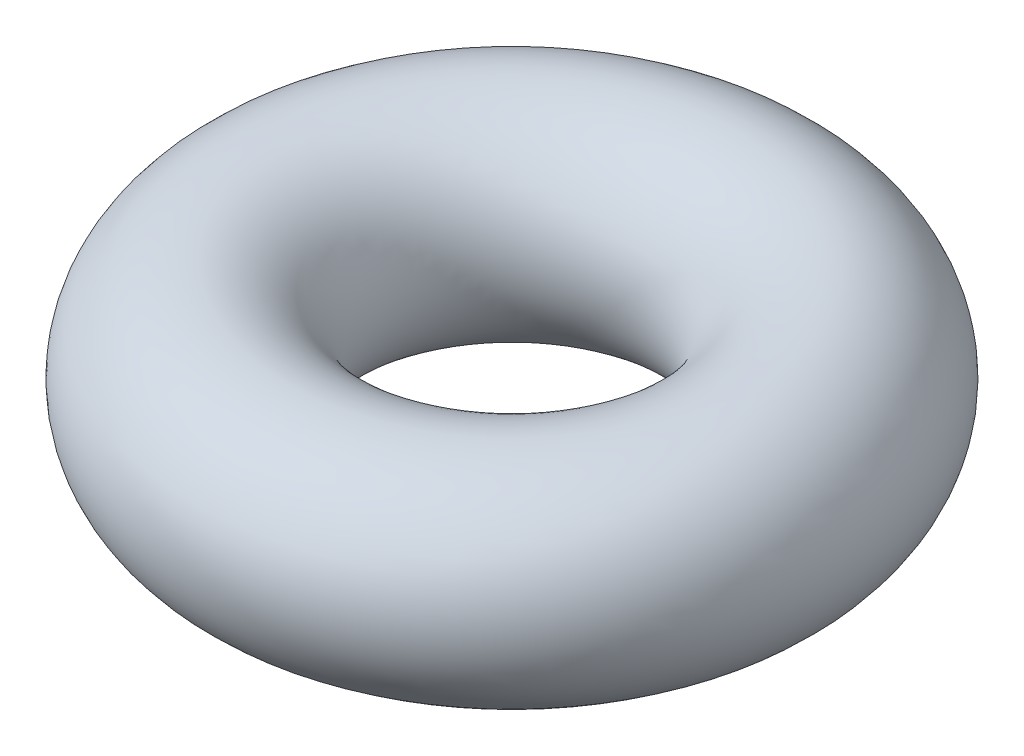
ISO-10303-21;
HEADER;
FILE_DESCRIPTION(('STEP AP214'),'2;1');
FILE_NAME('part.step','',(''),(''),'','','');
FILE_SCHEMA(('AUTOMOTIVE_DESIGN { 1 0 10303 214 1 1 1 1 }'));
ENDSEC;
DATA;
#1=APPLICATION_CONTEXT('core data for automotive mechanical design processes');
#2=APPLICATION_PROTOCOL_DEFINITION('international standard','automotive_design',2000,#1);
#3=PRODUCT_CONTEXT('',#1,'mechanical');
#4=PRODUCT('Part','Part','',(#3));
#5=PRODUCT_RELATED_PRODUCT_CATEGORY('part','',(#4));
#6=PRODUCT_DEFINITION_FORMATION('','',#4);
#7=PRODUCT_DEFINITION_CONTEXT('part definition',#1,'design');
#8=PRODUCT_DEFINITION('design','',#6,#7);
#9=PRODUCT_DEFINITION_SHAPE('','',#8);
#10=(LENGTH_UNIT() NAMED_UNIT(*) SI_UNIT(.MILLI.,.METRE.));
#11=(NAMED_UNIT(*) PLANE_ANGLE_UNIT() SI_UNIT($,.RADIAN.));
#12=(NAMED_UNIT(*) SI_UNIT($,.STERADIAN.) SOLID_ANGLE_UNIT());
#13=UNCERTAINTY_MEASURE_WITH_UNIT(LENGTH_MEASURE(1.E-05),#10,'distance_accuracy_value','');
#14=(GEOMETRIC_REPRESENTATION_CONTEXT(3) GLOBAL_UNCERTAINTY_ASSIGNED_CONTEXT((#13)) GLOBAL_UNIT_ASSIGNED_CONTEXT((#10,
#11,#12)) REPRESENTATION_CONTEXT('',''));
#15=CARTESIAN_POINT('',(0.,0.,0.));
#16=DIRECTION('',(0.,0.,1.));
#17=DIRECTION('',(1.,0.,0.));
#18=AXIS2_PLACEMENT_3D('',#15,#16,#17);
#19=CARTESIAN_POINT('',(0.,0.,0.));
#20=DIRECTION('',(0.,-1.,0.));
#21=DIRECTION('',(1.,0.,0.));
#22=AXIS2_PLACEMENT_3D('',#19,#20,#21);
#23=TOROIDAL_SURFACE('',#22,2.0475,0.952500000000001);
#24=CARTESIAN_POINT('',(3.,0.,0.));
#25=VERTEX_POINT('',#24);
#26=VERTEX_LOOP('',#25);
#27=FACE_BOUND('',#26,.T.);
#28=ADVANCED_FACE('F30',(#27),#23,.T.);
#29=CLOSED_SHELL('',(#28));
#30=MANIFOLD_SOLID_BREP('B2',#29);
#31=ADVANCED_BREP_SHAPE_REPRESENTATION('',(#18,#30),#14);
#32=SHAPE_DEFINITION_REPRESENTATION(#9,#31);
ENDSEC;
END-ISO-10303-21;
